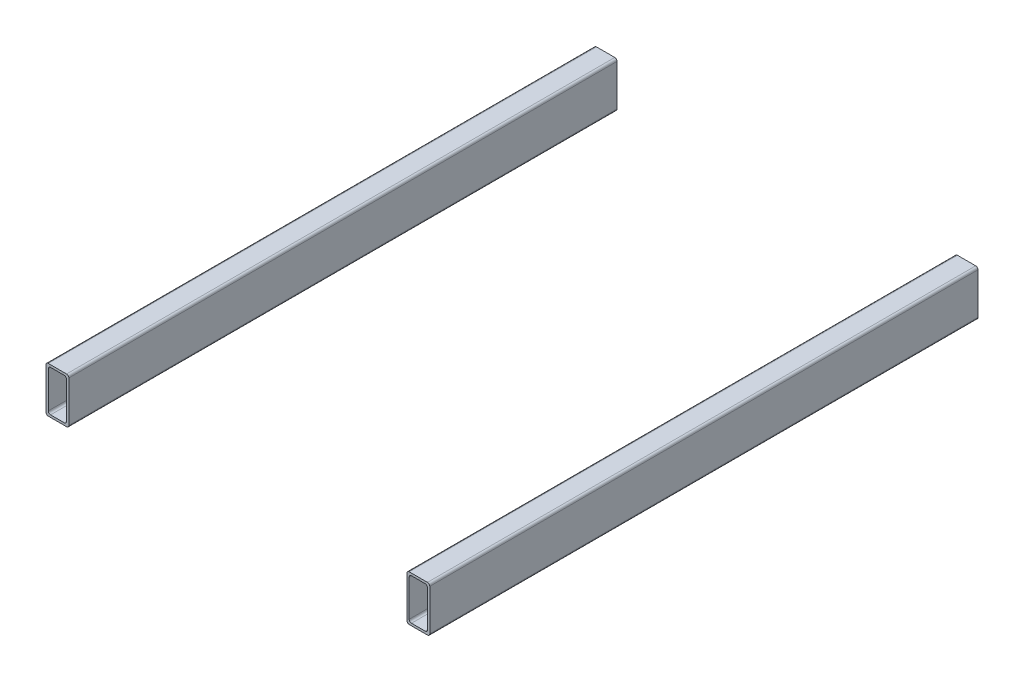
ISO-10303-21;
HEADER;
FILE_DESCRIPTION(('STEP AP214'),'2;1');
FILE_NAME('part.step','',(''),(''),'','','');
FILE_SCHEMA(('AUTOMOTIVE_DESIGN { 1 0 10303 214 1 1 1 1 }'));
ENDSEC;
DATA;
#1=APPLICATION_CONTEXT('core data for automotive mechanical design processes');
#2=APPLICATION_PROTOCOL_DEFINITION('international standard','automotive_design',2000,#1);
#3=PRODUCT_CONTEXT('',#1,'mechanical');
#4=PRODUCT('Part','Part','',(#3));
#5=PRODUCT_RELATED_PRODUCT_CATEGORY('part','',(#4));
#6=PRODUCT_DEFINITION_FORMATION('','',#4);
#7=PRODUCT_DEFINITION_CONTEXT('part definition',#1,'design');
#8=PRODUCT_DEFINITION('design','',#6,#7);
#9=PRODUCT_DEFINITION_SHAPE('','',#8);
#10=(LENGTH_UNIT() NAMED_UNIT(*) SI_UNIT(.MILLI.,.METRE.));
#11=(NAMED_UNIT(*) PLANE_ANGLE_UNIT() SI_UNIT($,.RADIAN.));
#12=(NAMED_UNIT(*) SI_UNIT($,.STERADIAN.) SOLID_ANGLE_UNIT());
#13=UNCERTAINTY_MEASURE_WITH_UNIT(LENGTH_MEASURE(1.E-05),#10,'distance_accuracy_value','');
#14=(GEOMETRIC_REPRESENTATION_CONTEXT(3) GLOBAL_UNCERTAINTY_ASSIGNED_CONTEXT((#13)) GLOBAL_UNIT_ASSIGNED_CONTEXT((#10,
#11,#12)) REPRESENTATION_CONTEXT('',''));
#15=CARTESIAN_POINT('',(0.,0.,0.));
#16=DIRECTION('',(0.,0.,1.));
#17=DIRECTION('',(1.,0.,0.));
#18=AXIS2_PLACEMENT_3D('',#15,#16,#17);
#19=CARTESIAN_POINT('',(385.,47.4999999999999,-600.));
#20=DIRECTION('',(0.,0.,1.));
#21=DIRECTION('',(1.,0.,0.));
#22=AXIS2_PLACEMENT_3D('',#19,#20,#21);
#23=CYLINDRICAL_SURFACE('',#22,2.50000000000028);
#24=CARTESIAN_POINT('',(385.,47.4999999999999,0.));
#25=DIRECTION('',(0.,0.,1.));
#26=DIRECTION('',(1.,0.,0.));
#27=AXIS2_PLACEMENT_3D('',#24,#25,#26);
#28=CIRCLE('',#27,2.50000000000028);
#29=CARTESIAN_POINT('',(385.,50.,0.));
#30=VERTEX_POINT('',#29);
#31=CARTESIAN_POINT('',(382.499999999999,47.4999999999999,0.));
#32=VERTEX_POINT('',#31);
#33=EDGE_CURVE('E213',#30,#32,#28,.T.);
#34=ORIENTED_EDGE('',*,*,#33,.F.);
#35=DIRECTION('',(0.,0.,1.));
#36=VECTOR('',#35,1.);
#37=CARTESIAN_POINT('',(385.,50.,-600.));
#38=LINE('',#37,#36);
#39=CARTESIAN_POINT('',(385.,50.,-600.));
#40=VERTEX_POINT('',#39);
#41=EDGE_CURVE('E12',#40,#30,#38,.T.);
#42=ORIENTED_EDGE('',*,*,#41,.F.);
#43=CARTESIAN_POINT('',(385.,47.4999999999999,-600.));
#44=DIRECTION('',(0.,0.,1.));
#45=DIRECTION('',(1.,0.,0.));
#46=AXIS2_PLACEMENT_3D('',#43,#44,#45);
#47=CIRCLE('',#46,2.50000000000028);
#48=CARTESIAN_POINT('',(382.499999999999,47.4999999999999,-600.));
#49=VERTEX_POINT('',#48);
#50=EDGE_CURVE('E225',#40,#49,#47,.T.);
#51=ORIENTED_EDGE('',*,*,#50,.T.);
#52=DIRECTION('',(0.,0.,1.));
#53=VECTOR('',#52,1.);
#54=CARTESIAN_POINT('',(382.499999999999,47.4999999999999,-600.));
#55=LINE('',#54,#53);
#56=EDGE_CURVE('E46',#49,#32,#55,.T.);
#57=ORIENTED_EDGE('',*,*,#56,.T.);
#58=EDGE_LOOP('',(#34,#42,#51,#57));
#59=FACE_BOUND('',#58,.T.);
#60=ADVANCED_FACE('F43',(#59),#23,.T.);
#61=CARTESIAN_POINT('',(385.,50.,-600.));
#62=DIRECTION('',(0.,1.,0.));
#63=DIRECTION('',(0.,0.,1.));
#64=AXIS2_PLACEMENT_3D('',#61,#62,#63);
#65=PLANE('',#64);
#66=DIRECTION('',(-1.,0.,0.));
#67=VECTOR('',#66,1.);
#68=CARTESIAN_POINT('',(385.,50.,0.));
#69=LINE('',#68,#67);
#70=CARTESIAN_POINT('',(404.999999999999,50.,0.));
#71=VERTEX_POINT('',#70);
#72=EDGE_CURVE('E229',#71,#30,#69,.T.);
#73=ORIENTED_EDGE('',*,*,#72,.F.);
#74=DIRECTION('',(0.,0.,1.));
#75=VECTOR('',#74,1.);
#76=CARTESIAN_POINT('',(404.999999999999,50.,-600.));
#77=LINE('',#76,#75);
#78=CARTESIAN_POINT('',(404.999999999999,50.,-600.));
#79=VERTEX_POINT('',#78);
#80=EDGE_CURVE('E51',#79,#71,#77,.T.);
#81=ORIENTED_EDGE('',*,*,#80,.F.);
#82=DIRECTION('',(-1.,0.,0.));
#83=VECTOR('',#82,1.);
#84=CARTESIAN_POINT('',(385.,50.,-600.));
#85=LINE('',#84,#83);
#86=EDGE_CURVE('E247',#79,#40,#85,.T.);
#87=ORIENTED_EDGE('',*,*,#86,.T.);
#88=ORIENTED_EDGE('',*,*,#41,.T.);
#89=EDGE_LOOP('',(#73,#81,#87,#88));
#90=FACE_BOUND('',#89,.T.);
#91=ADVANCED_FACE('F294',(#90),#65,.T.);
#92=CARTESIAN_POINT('',(404.999999999999,47.4999999999999,-600.));
#93=DIRECTION('',(0.,0.,1.));
#94=DIRECTION('',(1.,0.,0.));
#95=AXIS2_PLACEMENT_3D('',#92,#93,#94);
#96=CYLINDRICAL_SURFACE('',#95,2.50000000000028);
#97=CARTESIAN_POINT('',(404.999999999999,47.4999999999999,0.));
#98=DIRECTION('',(0.,0.,1.));
#99=DIRECTION('',(1.,0.,0.));
#100=AXIS2_PLACEMENT_3D('',#97,#98,#99);
#101=CIRCLE('',#100,2.50000000000028);
#102=CARTESIAN_POINT('',(407.5,47.4999999999999,0.));
#103=VERTEX_POINT('',#102);
#104=EDGE_CURVE('E267',#103,#71,#101,.T.);
#105=ORIENTED_EDGE('',*,*,#104,.F.);
#106=DIRECTION('',(0.,0.,1.));
#107=VECTOR('',#106,1.);
#108=CARTESIAN_POINT('',(407.5,47.4999999999999,-600.));
#109=LINE('',#108,#107);
#110=CARTESIAN_POINT('',(407.5,47.4999999999999,-600.));
#111=VERTEX_POINT('',#110);
#112=EDGE_CURVE('E273',#111,#103,#109,.T.);
#113=ORIENTED_EDGE('',*,*,#112,.F.);
#114=CARTESIAN_POINT('',(404.999999999999,47.4999999999999,-600.));
#115=DIRECTION('',(0.,0.,1.));
#116=DIRECTION('',(1.,0.,0.));
#117=AXIS2_PLACEMENT_3D('',#114,#115,#116);
#118=CIRCLE('',#117,2.50000000000028);
#119=EDGE_CURVE('E244',#111,#79,#118,.T.);
#120=ORIENTED_EDGE('',*,*,#119,.T.);
#121=ORIENTED_EDGE('',*,*,#80,.T.);
#122=EDGE_LOOP('',(#105,#113,#120,#121));
#123=FACE_BOUND('',#122,.T.);
#124=ADVANCED_FACE('F313',(#123),#96,.T.);
#125=CARTESIAN_POINT('',(407.5,47.4999999999999,-600.));
#126=DIRECTION('',(1.,0.,0.));
#127=DIRECTION('',(0.,0.,-1.));
#128=AXIS2_PLACEMENT_3D('',#125,#126,#127);
#129=PLANE('',#128);
#130=DIRECTION('',(0.,1.,0.));
#131=VECTOR('',#130,1.);
#132=CARTESIAN_POINT('',(407.5,47.4999999999999,0.));
#133=LINE('',#132,#131);
#134=CARTESIAN_POINT('',(407.5,2.49999999999995,0.));
#135=VERTEX_POINT('',#134);
#136=EDGE_CURVE('E264',#135,#103,#133,.T.);
#137=ORIENTED_EDGE('',*,*,#136,.F.);
#138=DIRECTION('',(0.,0.,1.));
#139=VECTOR('',#138,1.);
#140=CARTESIAN_POINT('',(407.5,2.49999999999995,-600.));
#141=LINE('',#140,#139);
#142=CARTESIAN_POINT('',(407.5,2.49999999999995,-600.));
#143=VERTEX_POINT('',#142);
#144=EDGE_CURVE('E275',#143,#135,#141,.T.);
#145=ORIENTED_EDGE('',*,*,#144,.F.);
#146=DIRECTION('',(0.,1.,0.));
#147=VECTOR('',#146,1.);
#148=CARTESIAN_POINT('',(407.5,47.4999999999999,-600.));
#149=LINE('',#148,#147);
#150=EDGE_CURVE('E241',#143,#111,#149,.T.);
#151=ORIENTED_EDGE('',*,*,#150,.T.);
#152=ORIENTED_EDGE('',*,*,#112,.T.);
#153=EDGE_LOOP('',(#137,#145,#151,#152));
#154=FACE_BOUND('',#153,.T.);
#155=ADVANCED_FACE('F311',(#154),#129,.T.);
#156=CARTESIAN_POINT('',(404.999999999999,2.49999999999995,-600.));
#157=DIRECTION('',(0.,0.,1.));
#158=DIRECTION('',(1.,0.,0.));
#159=AXIS2_PLACEMENT_3D('',#156,#157,#158);
#160=CYLINDRICAL_SURFACE('',#159,2.50000000000017);
#161=CARTESIAN_POINT('',(404.999999999999,2.49999999999995,0.));
#162=DIRECTION('',(0.,0.,1.));
#163=DIRECTION('',(1.,0.,0.));
#164=AXIS2_PLACEMENT_3D('',#161,#162,#163);
#165=CIRCLE('',#164,2.50000000000017);
#166=CARTESIAN_POINT('',(404.999999999999,-2.22044604925031E-13,0.));
#167=VERTEX_POINT('',#166);
#168=EDGE_CURVE('E261',#167,#135,#165,.T.);
#169=ORIENTED_EDGE('',*,*,#168,.F.);
#170=DIRECTION('',(0.,0.,1.));
#171=VECTOR('',#170,1.);
#172=CARTESIAN_POINT('',(404.999999999999,-2.22044604925031E-13,-600.));
#173=LINE('',#172,#171);
#174=CARTESIAN_POINT('',(404.999999999999,-2.22044604925031E-13,-600.));
#175=VERTEX_POINT('',#174);
#176=EDGE_CURVE('E277',#175,#167,#173,.T.);
#177=ORIENTED_EDGE('',*,*,#176,.F.);
#178=CARTESIAN_POINT('',(404.999999999999,2.49999999999995,-600.));
#179=DIRECTION('',(0.,0.,1.));
#180=DIRECTION('',(1.,0.,0.));
#181=AXIS2_PLACEMENT_3D('',#178,#179,#180);
#182=CIRCLE('',#181,2.50000000000017);
#183=EDGE_CURVE('E238',#175,#143,#182,.T.);
#184=ORIENTED_EDGE('',*,*,#183,.T.);
#185=ORIENTED_EDGE('',*,*,#144,.T.);
#186=EDGE_LOOP('',(#169,#177,#184,#185));
#187=FACE_BOUND('',#186,.T.);
#188=ADVANCED_FACE('F307',(#187),#160,.T.);
#189=CARTESIAN_POINT('',(404.999999999999,0.,-600.));
#190=DIRECTION('',(0.,-1.,0.));
#191=DIRECTION('',(0.,0.,-1.));
#192=AXIS2_PLACEMENT_3D('',#189,#190,#191);
#193=PLANE('',#192);
#194=DIRECTION('',(1.,0.,0.));
#195=VECTOR('',#194,1.);
#196=CARTESIAN_POINT('',(404.999999999999,0.,0.));
#197=LINE('',#196,#195);
#198=CARTESIAN_POINT('',(385.,0.,0.));
#199=VERTEX_POINT('',#198);
#200=EDGE_CURVE('E258',#199,#167,#197,.T.);
#201=ORIENTED_EDGE('',*,*,#200,.F.);
#202=DIRECTION('',(0.,0.,1.));
#203=VECTOR('',#202,1.);
#204=CARTESIAN_POINT('',(385.,0.,-600.));
#205=LINE('',#204,#203);
#206=CARTESIAN_POINT('',(385.,0.,-600.));
#207=VERTEX_POINT('',#206);
#208=EDGE_CURVE('E279',#207,#199,#205,.T.);
#209=ORIENTED_EDGE('',*,*,#208,.F.);
#210=DIRECTION('',(1.,0.,0.));
#211=VECTOR('',#210,1.);
#212=CARTESIAN_POINT('',(404.999999999999,0.,-600.));
#213=LINE('',#212,#211);
#214=EDGE_CURVE('E235',#207,#175,#213,.T.);
#215=ORIENTED_EDGE('',*,*,#214,.T.);
#216=ORIENTED_EDGE('',*,*,#176,.T.);
#217=EDGE_LOOP('',(#201,#209,#215,#216));
#218=FACE_BOUND('',#217,.T.);
#219=ADVANCED_FACE('F305',(#218),#193,.T.);
#220=CARTESIAN_POINT('',(385.,2.49999999999995,-600.));
#221=DIRECTION('',(0.,0.,1.));
#222=DIRECTION('',(1.,0.,0.));
#223=AXIS2_PLACEMENT_3D('',#220,#221,#222);
#224=CYLINDRICAL_SURFACE('',#223,2.50000000000017);
#225=CARTESIAN_POINT('',(385.,2.49999999999995,0.));
#226=DIRECTION('',(0.,0.,1.));
#227=DIRECTION('',(1.,0.,0.));
#228=AXIS2_PLACEMENT_3D('',#225,#226,#227);
#229=CIRCLE('',#228,2.50000000000017);
#230=CARTESIAN_POINT('',(382.5,2.49999999999995,0.));
#231=VERTEX_POINT('',#230);
#232=EDGE_CURVE('E255',#231,#199,#229,.T.);
#233=ORIENTED_EDGE('',*,*,#232,.F.);
#234=DIRECTION('',(0.,0.,1.));
#235=VECTOR('',#234,1.);
#236=CARTESIAN_POINT('',(382.5,2.49999999999995,-600.));
#237=LINE('',#236,#235);
#238=CARTESIAN_POINT('',(382.5,2.49999999999995,-600.));
#239=VERTEX_POINT('',#238);
#240=EDGE_CURVE('E280',#239,#231,#237,.T.);
#241=ORIENTED_EDGE('',*,*,#240,.F.);
#242=CARTESIAN_POINT('',(385.,2.49999999999995,-600.));
#243=DIRECTION('',(0.,0.,1.));
#244=DIRECTION('',(1.,0.,0.));
#245=AXIS2_PLACEMENT_3D('',#242,#243,#244);
#246=CIRCLE('',#245,2.50000000000017);
#247=EDGE_CURVE('E232',#239,#207,#246,.T.);
#248=ORIENTED_EDGE('',*,*,#247,.T.);
#249=ORIENTED_EDGE('',*,*,#208,.T.);
#250=EDGE_LOOP('',(#233,#241,#248,#249));
#251=FACE_BOUND('',#250,.T.);
#252=ADVANCED_FACE('F301',(#251),#224,.T.);
#253=CARTESIAN_POINT('',(382.499999999999,2.49999999999995,-600.));
#254=DIRECTION('',(-1.,0.,0.));
#255=DIRECTION('',(0.,0.,1.));
#256=AXIS2_PLACEMENT_3D('',#253,#254,#255);
#257=PLANE('',#256);
#258=DIRECTION('',(0.,-1.,0.));
#259=VECTOR('',#258,1.);
#260=CARTESIAN_POINT('',(382.499999999999,2.49999999999995,0.));
#261=LINE('',#260,#259);
#262=EDGE_CURVE('E252',#32,#231,#261,.T.);
#263=ORIENTED_EDGE('',*,*,#262,.F.);
#264=ORIENTED_EDGE('',*,*,#56,.F.);
#265=DIRECTION('',(0.,-1.,0.));
#266=VECTOR('',#265,1.);
#267=CARTESIAN_POINT('',(382.499999999999,2.49999999999995,-600.));
#268=LINE('',#267,#266);
#269=EDGE_CURVE('E228',#49,#239,#268,.T.);
#270=ORIENTED_EDGE('',*,*,#269,.T.);
#271=ORIENTED_EDGE('',*,*,#240,.T.);
#272=EDGE_LOOP('',(#263,#264,#270,#271));
#273=FACE_BOUND('',#272,.T.);
#274=ADVANCED_FACE('F288',(#273),#257,.T.);
#275=CARTESIAN_POINT('',(385.,47.4999999999999,-600.));
#276=DIRECTION('',(0.,0.,1.));
#277=DIRECTION('',(1.,0.,0.));
#278=AXIS2_PLACEMENT_3D('',#275,#276,#277);
#279=PLANE('',#278);
#280=DIRECTION('',(-1.,0.,0.));
#281=VECTOR('',#280,1.);
#282=CARTESIAN_POINT('',(387.499999999999,47.4999999999999,-600.));
#283=LINE('',#282,#281);
#284=CARTESIAN_POINT('',(402.5,47.4999999999999,-600.));
#285=VERTEX_POINT('',#284);
#286=CARTESIAN_POINT('',(387.499999999999,47.4999999999999,-600.));
#287=VERTEX_POINT('',#286);
#288=EDGE_CURVE('E164',#285,#287,#283,.T.);
#289=ORIENTED_EDGE('',*,*,#288,.T.);
#290=CARTESIAN_POINT('',(387.499999999999,44.9999999999999,-600.));
#291=DIRECTION('',(0.,0.,1.));
#292=DIRECTION('',(1.,0.,0.));
#293=AXIS2_PLACEMENT_3D('',#290,#291,#292);
#294=CIRCLE('',#293,2.49999999999972);
#295=CARTESIAN_POINT('',(385.,44.9999999999999,-600.));
#296=VERTEX_POINT('',#295);
#297=EDGE_CURVE('E158',#287,#296,#294,.T.);
#298=ORIENTED_EDGE('',*,*,#297,.T.);
#299=DIRECTION('',(0.,-1.,0.));
#300=VECTOR('',#299,1.);
#301=CARTESIAN_POINT('',(385.,4.99999999999989,-600.));
#302=LINE('',#301,#300);
#303=CARTESIAN_POINT('',(385.,4.99999999999989,-600.));
#304=VERTEX_POINT('',#303);
#305=EDGE_CURVE('E167',#296,#304,#302,.T.);
#306=ORIENTED_EDGE('',*,*,#305,.T.);
#307=CARTESIAN_POINT('',(387.499999999999,4.99999999999989,-600.));
#308=DIRECTION('',(0.,0.,1.));
#309=DIRECTION('',(1.,0.,0.));
#310=AXIS2_PLACEMENT_3D('',#307,#308,#309);
#311=CIRCLE('',#310,2.49999999999972);
#312=CARTESIAN_POINT('',(387.499999999999,2.49999999999995,-600.));
#313=VERTEX_POINT('',#312);
#314=EDGE_CURVE('E59',#304,#313,#311,.T.);
#315=ORIENTED_EDGE('',*,*,#314,.T.);
#316=DIRECTION('',(1.,0.,0.));
#317=VECTOR('',#316,1.);
#318=CARTESIAN_POINT('',(402.499999999999,2.49999999999995,-600.));
#319=LINE('',#318,#317);
#320=CARTESIAN_POINT('',(402.499999999999,2.49999999999972,-600.));
#321=VERTEX_POINT('',#320);
#322=EDGE_CURVE('E182',#313,#321,#319,.T.);
#323=ORIENTED_EDGE('',*,*,#322,.T.);
#324=CARTESIAN_POINT('',(402.499999999999,4.99999999999989,-600.));
#325=DIRECTION('',(0.,0.,1.));
#326=DIRECTION('',(1.,0.,0.));
#327=AXIS2_PLACEMENT_3D('',#324,#325,#326);
#328=CIRCLE('',#327,2.50000000000017);
#329=CARTESIAN_POINT('',(404.999999999999,4.99999999999989,-600.));
#330=VERTEX_POINT('',#329);
#331=EDGE_CURVE('E185',#321,#330,#328,.T.);
#332=ORIENTED_EDGE('',*,*,#331,.T.);
#333=DIRECTION('',(0.,1.,0.));
#334=VECTOR('',#333,1.);
#335=CARTESIAN_POINT('',(404.999999999999,44.9999999999999,-600.));
#336=LINE('',#335,#334);
#337=CARTESIAN_POINT('',(404.999999999999,44.9999999999999,-600.));
#338=VERTEX_POINT('',#337);
#339=EDGE_CURVE('E188',#330,#338,#336,.T.);
#340=ORIENTED_EDGE('',*,*,#339,.T.);
#341=CARTESIAN_POINT('',(402.499999999999,44.9999999999999,-600.));
#342=DIRECTION('',(0.,0.,1.));
#343=DIRECTION('',(1.,0.,0.));
#344=AXIS2_PLACEMENT_3D('',#341,#342,#343);
#345=CIRCLE('',#344,2.50000000000017);
#346=EDGE_CURVE('E191',#338,#285,#345,.T.);
#347=ORIENTED_EDGE('',*,*,#346,.T.);
#348=EDGE_LOOP('',(#289,#298,#306,#315,#323,#332,#340,#347));
#349=FACE_BOUND('',#348,.T.);
#350=ORIENTED_EDGE('',*,*,#50,.F.);
#351=ORIENTED_EDGE('',*,*,#86,.F.);
#352=ORIENTED_EDGE('',*,*,#119,.F.);
#353=ORIENTED_EDGE('',*,*,#150,.F.);
#354=ORIENTED_EDGE('',*,*,#183,.F.);
#355=ORIENTED_EDGE('',*,*,#214,.F.);
#356=ORIENTED_EDGE('',*,*,#247,.F.);
#357=ORIENTED_EDGE('',*,*,#269,.F.);
#358=EDGE_LOOP('',(#350,#351,#352,#353,#354,#355,#356,#357));
#359=FACE_BOUND('',#358,.T.);
#360=ADVANCED_FACE('F171',(#349,#359),#279,.F.);
#361=CARTESIAN_POINT('',(385.,47.4999999999999,0.));
#362=DIRECTION('',(0.,0.,1.));
#363=DIRECTION('',(1.,0.,0.));
#364=AXIS2_PLACEMENT_3D('',#361,#362,#363);
#365=PLANE('',#364);
#366=CARTESIAN_POINT('',(387.499999999999,44.9999999999999,0.));
#367=DIRECTION('',(0.,0.,1.));
#368=DIRECTION('',(1.,0.,0.));
#369=AXIS2_PLACEMENT_3D('',#366,#367,#368);
#370=CIRCLE('',#369,2.49999999999972);
#371=CARTESIAN_POINT('',(387.499999999999,47.4999999999999,0.));
#372=VERTEX_POINT('',#371);
#373=CARTESIAN_POINT('',(385.,44.9999999999999,0.));
#374=VERTEX_POINT('',#373);
#375=EDGE_CURVE('E67',#372,#374,#370,.T.);
#376=ORIENTED_EDGE('',*,*,#375,.F.);
#377=DIRECTION('',(-1.,0.,0.));
#378=VECTOR('',#377,1.);
#379=CARTESIAN_POINT('',(387.499999999999,47.4999999999999,0.));
#380=LINE('',#379,#378);
#381=CARTESIAN_POINT('',(402.5,47.4999999999999,0.));
#382=VERTEX_POINT('',#381);
#383=EDGE_CURVE('E175',#382,#372,#380,.T.);
#384=ORIENTED_EDGE('',*,*,#383,.F.);
#385=CARTESIAN_POINT('',(402.499999999999,44.9999999999999,0.));
#386=DIRECTION('',(0.,0.,1.));
#387=DIRECTION('',(1.,0.,0.));
#388=AXIS2_PLACEMENT_3D('',#385,#386,#387);
#389=CIRCLE('',#388,2.50000000000017);
#390=CARTESIAN_POINT('',(404.999999999999,44.9999999999999,0.));
#391=VERTEX_POINT('',#390);
#392=EDGE_CURVE('E178',#391,#382,#389,.T.);
#393=ORIENTED_EDGE('',*,*,#392,.F.);
#394=DIRECTION('',(0.,1.,0.));
#395=VECTOR('',#394,1.);
#396=CARTESIAN_POINT('',(404.999999999999,44.9999999999999,0.));
#397=LINE('',#396,#395);
#398=CARTESIAN_POINT('',(404.999999999999,4.99999999999989,0.));
#399=VERTEX_POINT('',#398);
#400=EDGE_CURVE('E206',#399,#391,#397,.T.);
#401=ORIENTED_EDGE('',*,*,#400,.F.);
#402=CARTESIAN_POINT('',(402.499999999999,4.99999999999989,0.));
#403=DIRECTION('',(0.,0.,1.));
#404=DIRECTION('',(1.,0.,0.));
#405=AXIS2_PLACEMENT_3D('',#402,#403,#404);
#406=CIRCLE('',#405,2.50000000000017);
#407=CARTESIAN_POINT('',(402.499999999999,2.49999999999972,0.));
#408=VERTEX_POINT('',#407);
#409=EDGE_CURVE('E203',#408,#399,#406,.T.);
#410=ORIENTED_EDGE('',*,*,#409,.F.);
#411=DIRECTION('',(1.,0.,0.));
#412=VECTOR('',#411,1.);
#413=CARTESIAN_POINT('',(402.499999999999,2.49999999999995,0.));
#414=LINE('',#413,#412);
#415=CARTESIAN_POINT('',(387.499999999999,2.49999999999995,0.));
#416=VERTEX_POINT('',#415);
#417=EDGE_CURVE('E200',#416,#408,#414,.T.);
#418=ORIENTED_EDGE('',*,*,#417,.F.);
#419=CARTESIAN_POINT('',(387.499999999999,4.99999999999989,0.));
#420=DIRECTION('',(0.,0.,1.));
#421=DIRECTION('',(1.,0.,0.));
#422=AXIS2_PLACEMENT_3D('',#419,#420,#421);
#423=CIRCLE('',#422,2.49999999999972);
#424=CARTESIAN_POINT('',(385.,4.99999999999989,0.));
#425=VERTEX_POINT('',#424);
#426=EDGE_CURVE('E197',#425,#416,#423,.T.);
#427=ORIENTED_EDGE('',*,*,#426,.F.);
#428=DIRECTION('',(0.,-1.,0.));
#429=VECTOR('',#428,1.);
#430=CARTESIAN_POINT('',(385.,4.99999999999989,0.));
#431=LINE('',#430,#429);
#432=EDGE_CURVE('E195',#374,#425,#431,.T.);
#433=ORIENTED_EDGE('',*,*,#432,.F.);
#434=EDGE_LOOP('',(#376,#384,#393,#401,#410,#418,#427,#433));
#435=FACE_BOUND('',#434,.T.);
#436=ORIENTED_EDGE('',*,*,#33,.T.);
#437=ORIENTED_EDGE('',*,*,#262,.T.);
#438=ORIENTED_EDGE('',*,*,#232,.T.);
#439=ORIENTED_EDGE('',*,*,#200,.T.);
#440=ORIENTED_EDGE('',*,*,#168,.T.);
#441=ORIENTED_EDGE('',*,*,#136,.T.);
#442=ORIENTED_EDGE('',*,*,#104,.T.);
#443=ORIENTED_EDGE('',*,*,#72,.T.);
#444=EDGE_LOOP('',(#436,#437,#438,#439,#440,#441,#442,#443));
#445=FACE_BOUND('',#444,.T.);
#446=ADVANCED_FACE('F290',(#435,#445),#365,.T.);
#447=CARTESIAN_POINT('',(387.499999999999,44.9999999999999,-600.));
#448=DIRECTION('',(0.,0.,1.));
#449=DIRECTION('',(1.,0.,0.));
#450=AXIS2_PLACEMENT_3D('',#447,#448,#449);
#451=CYLINDRICAL_SURFACE('',#450,2.49999999999972);
#452=ORIENTED_EDGE('',*,*,#375,.T.);
#453=DIRECTION('',(0.,0.,1.));
#454=VECTOR('',#453,1.);
#455=CARTESIAN_POINT('',(385.,44.9999999999999,-600.));
#456=LINE('',#455,#454);
#457=EDGE_CURVE('E154',#296,#374,#456,.T.);
#458=ORIENTED_EDGE('',*,*,#457,.F.);
#459=ORIENTED_EDGE('',*,*,#297,.F.);
#460=DIRECTION('',(0.,0.,1.));
#461=VECTOR('',#460,1.);
#462=CARTESIAN_POINT('',(387.499999999999,47.4999999999999,-600.));
#463=LINE('',#462,#461);
#464=EDGE_CURVE('E211',#287,#372,#463,.T.);
#465=ORIENTED_EDGE('',*,*,#464,.T.);
#466=EDGE_LOOP('',(#452,#458,#459,#465));
#467=FACE_BOUND('',#466,.T.);
#468=ADVANCED_FACE('F156',(#467),#451,.F.);
#469=CARTESIAN_POINT('',(387.499999999999,47.4999999999999,-600.));
#470=DIRECTION('',(0.,1.,0.));
#471=DIRECTION('',(0.,0.,1.));
#472=AXIS2_PLACEMENT_3D('',#469,#470,#471);
#473=PLANE('',#472);
#474=ORIENTED_EDGE('',*,*,#383,.T.);
#475=ORIENTED_EDGE('',*,*,#464,.F.);
#476=ORIENTED_EDGE('',*,*,#288,.F.);
#477=DIRECTION('',(0.,0.,1.));
#478=VECTOR('',#477,1.);
#479=CARTESIAN_POINT('',(402.5,47.4999999999999,-600.));
#480=LINE('',#479,#478);
#481=EDGE_CURVE('E214',#285,#382,#480,.T.);
#482=ORIENTED_EDGE('',*,*,#481,.T.);
#483=EDGE_LOOP('',(#474,#475,#476,#482));
#484=FACE_BOUND('',#483,.T.);
#485=ADVANCED_FACE('F396',(#484),#473,.F.);
#486=CARTESIAN_POINT('',(402.499999999999,44.9999999999999,-600.));
#487=DIRECTION('',(0.,0.,1.));
#488=DIRECTION('',(1.,0.,0.));
#489=AXIS2_PLACEMENT_3D('',#486,#487,#488);
#490=CYLINDRICAL_SURFACE('',#489,2.50000000000017);
#491=ORIENTED_EDGE('',*,*,#392,.T.);
#492=ORIENTED_EDGE('',*,*,#481,.F.);
#493=ORIENTED_EDGE('',*,*,#346,.F.);
#494=DIRECTION('',(0.,0.,1.));
#495=VECTOR('',#494,1.);
#496=CARTESIAN_POINT('',(404.999999999999,44.9999999999999,-600.));
#497=LINE('',#496,#495);
#498=EDGE_CURVE('E216',#338,#391,#497,.T.);
#499=ORIENTED_EDGE('',*,*,#498,.T.);
#500=EDGE_LOOP('',(#491,#492,#493,#499));
#501=FACE_BOUND('',#500,.T.);
#502=ADVANCED_FACE('F405',(#501),#490,.F.);
#503=CARTESIAN_POINT('',(404.999999999999,44.9999999999999,-600.));
#504=DIRECTION('',(1.,0.,0.));
#505=DIRECTION('',(0.,0.,-1.));
#506=AXIS2_PLACEMENT_3D('',#503,#504,#505);
#507=PLANE('',#506);
#508=ORIENTED_EDGE('',*,*,#400,.T.);
#509=ORIENTED_EDGE('',*,*,#498,.F.);
#510=ORIENTED_EDGE('',*,*,#339,.F.);
#511=DIRECTION('',(0.,0.,1.));
#512=VECTOR('',#511,1.);
#513=CARTESIAN_POINT('',(404.999999999999,4.99999999999989,-600.));
#514=LINE('',#513,#512);
#515=EDGE_CURVE('E218',#330,#399,#514,.T.);
#516=ORIENTED_EDGE('',*,*,#515,.T.);
#517=EDGE_LOOP('',(#508,#509,#510,#516));
#518=FACE_BOUND('',#517,.T.);
#519=ADVANCED_FACE('F415',(#518),#507,.F.);
#520=CARTESIAN_POINT('',(402.499999999999,4.99999999999989,-600.));
#521=DIRECTION('',(0.,0.,1.));
#522=DIRECTION('',(1.,0.,0.));
#523=AXIS2_PLACEMENT_3D('',#520,#521,#522);
#524=CYLINDRICAL_SURFACE('',#523,2.50000000000017);
#525=ORIENTED_EDGE('',*,*,#409,.T.);
#526=ORIENTED_EDGE('',*,*,#515,.F.);
#527=ORIENTED_EDGE('',*,*,#331,.F.);
#528=DIRECTION('',(0.,0.,1.));
#529=VECTOR('',#528,1.);
#530=CARTESIAN_POINT('',(402.499999999999,2.49999999999972,-600.));
#531=LINE('',#530,#529);
#532=EDGE_CURVE('E220',#321,#408,#531,.T.);
#533=ORIENTED_EDGE('',*,*,#532,.T.);
#534=EDGE_LOOP('',(#525,#526,#527,#533));
#535=FACE_BOUND('',#534,.T.);
#536=ADVANCED_FACE('F425',(#535),#524,.F.);
#537=CARTESIAN_POINT('',(402.499999999999,2.49999999999995,-600.));
#538=DIRECTION('',(0.,-1.,0.));
#539=DIRECTION('',(0.,0.,-1.));
#540=AXIS2_PLACEMENT_3D('',#537,#538,#539);
#541=PLANE('',#540);
#542=ORIENTED_EDGE('',*,*,#417,.T.);
#543=ORIENTED_EDGE('',*,*,#532,.F.);
#544=ORIENTED_EDGE('',*,*,#322,.F.);
#545=DIRECTION('',(0.,0.,1.));
#546=VECTOR('',#545,1.);
#547=CARTESIAN_POINT('',(387.499999999999,2.49999999999995,-600.));
#548=LINE('',#547,#546);
#549=EDGE_CURVE('E222',#313,#416,#548,.T.);
#550=ORIENTED_EDGE('',*,*,#549,.T.);
#551=EDGE_LOOP('',(#542,#543,#544,#550));
#552=FACE_BOUND('',#551,.T.);
#553=ADVANCED_FACE('F435',(#552),#541,.F.);
#554=CARTESIAN_POINT('',(387.499999999999,4.99999999999989,-600.));
#555=DIRECTION('',(0.,0.,1.));
#556=DIRECTION('',(1.,0.,0.));
#557=AXIS2_PLACEMENT_3D('',#554,#555,#556);
#558=CYLINDRICAL_SURFACE('',#557,2.49999999999972);
#559=ORIENTED_EDGE('',*,*,#426,.T.);
#560=ORIENTED_EDGE('',*,*,#549,.F.);
#561=ORIENTED_EDGE('',*,*,#314,.F.);
#562=DIRECTION('',(0.,0.,1.));
#563=VECTOR('',#562,1.);
#564=CARTESIAN_POINT('',(385.,4.99999999999989,-600.));
#565=LINE('',#564,#563);
#566=EDGE_CURVE('E163',#304,#425,#565,.T.);
#567=ORIENTED_EDGE('',*,*,#566,.T.);
#568=EDGE_LOOP('',(#559,#560,#561,#567));
#569=FACE_BOUND('',#568,.T.);
#570=ADVANCED_FACE('F445',(#569),#558,.F.);
#571=CARTESIAN_POINT('',(385.,4.99999999999989,-600.));
#572=DIRECTION('',(-1.,0.,0.));
#573=DIRECTION('',(0.,0.,1.));
#574=AXIS2_PLACEMENT_3D('',#571,#572,#573);
#575=PLANE('',#574);
#576=ORIENTED_EDGE('',*,*,#432,.T.);
#577=ORIENTED_EDGE('',*,*,#566,.F.);
#578=ORIENTED_EDGE('',*,*,#305,.F.);
#579=ORIENTED_EDGE('',*,*,#457,.T.);
#580=EDGE_LOOP('',(#576,#577,#578,#579));
#581=FACE_BOUND('',#580,.T.);
#582=ADVANCED_FACE('F168',(#581),#575,.F.);
#583=CLOSED_SHELL('',(#60,#91,#124,#155,#188,#219,#252,#274,#360,#446,#468,#485,#502,#519,#536,
#553,#570,#582));
#584=MANIFOLD_SOLID_BREP('B2',#583);
#585=CARTESIAN_POINT('',(-10.0000000000002,47.4999999999999,-600.));
#586=DIRECTION('',(0.,0.,1.));
#587=DIRECTION('',(1.,0.,0.));
#588=AXIS2_PLACEMENT_3D('',#585,#586,#587);
#589=CYLINDRICAL_SURFACE('',#588,2.50000000000006);
#590=CARTESIAN_POINT('',(-10.0000000000002,47.4999999999999,0.));
#591=DIRECTION('',(0.,0.,1.));
#592=DIRECTION('',(1.,0.,0.));
#593=AXIS2_PLACEMENT_3D('',#590,#591,#592);
#594=CIRCLE('',#593,2.50000000000006);
#595=CARTESIAN_POINT('',(-10.0000000000002,50.,0.));
#596=VERTEX_POINT('',#595);
#597=CARTESIAN_POINT('',(-12.5000000000002,47.4999999999999,0.));
#598=VERTEX_POINT('',#597);
#599=EDGE_CURVE('E651',#596,#598,#594,.T.);
#600=ORIENTED_EDGE('',*,*,#599,.F.);
#601=DIRECTION('',(0.,0.,1.));
#602=VECTOR('',#601,1.);
#603=CARTESIAN_POINT('',(-10.0000000000002,50.,-600.));
#604=LINE('',#603,#602);
#605=CARTESIAN_POINT('',(-10.0000000000002,50.,-600.));
#606=VERTEX_POINT('',#605);
#607=EDGE_CURVE('E41',#606,#596,#604,.T.);
#608=ORIENTED_EDGE('',*,*,#607,.F.);
#609=CARTESIAN_POINT('',(-10.0000000000002,47.4999999999999,-600.));
#610=DIRECTION('',(0.,0.,1.));
#611=DIRECTION('',(1.,0.,0.));
#612=AXIS2_PLACEMENT_3D('',#609,#610,#611);
#613=CIRCLE('',#612,2.50000000000006);
#614=CARTESIAN_POINT('',(-12.5000000000002,47.4999999999999,-600.));
#615=VERTEX_POINT('',#614);
#616=EDGE_CURVE('E663',#606,#615,#613,.T.);
#617=ORIENTED_EDGE('',*,*,#616,.T.);
#618=DIRECTION('',(0.,0.,1.));
#619=VECTOR('',#618,1.);
#620=CARTESIAN_POINT('',(-12.5000000000002,47.4999999999999,-600.));
#621=LINE('',#620,#619);
#622=EDGE_CURVE('E484',#615,#598,#621,.T.);
#623=ORIENTED_EDGE('',*,*,#622,.T.);
#624=EDGE_LOOP('',(#600,#608,#617,#623));
#625=FACE_BOUND('',#624,.T.);
#626=ADVANCED_FACE('F481',(#625),#589,.T.);
#627=CARTESIAN_POINT('',(-10.0000000000002,50.,-600.));
#628=DIRECTION('',(0.,1.,0.));
#629=DIRECTION('',(0.,0.,1.));
#630=AXIS2_PLACEMENT_3D('',#627,#628,#629);
#631=PLANE('',#630);
#632=DIRECTION('',(-1.,0.,0.));
#633=VECTOR('',#632,1.);
#634=CARTESIAN_POINT('',(-10.0000000000002,50.,0.));
#635=LINE('',#634,#633);
#636=CARTESIAN_POINT('',(9.99999999999979,50.,0.));
#637=VERTEX_POINT('',#636);
#638=EDGE_CURVE('E667',#637,#596,#635,.T.);
#639=ORIENTED_EDGE('',*,*,#638,.F.);
#640=DIRECTION('',(0.,0.,1.));
#641=VECTOR('',#640,1.);
#642=CARTESIAN_POINT('',(9.99999999999979,50.,-600.));
#643=LINE('',#642,#641);
#644=CARTESIAN_POINT('',(9.99999999999979,50.,-600.));
#645=VERTEX_POINT('',#644);
#646=EDGE_CURVE('E489',#645,#637,#643,.T.);
#647=ORIENTED_EDGE('',*,*,#646,.F.);
#648=DIRECTION('',(-1.,0.,0.));
#649=VECTOR('',#648,1.);
#650=CARTESIAN_POINT('',(-10.0000000000002,50.,-600.));
#651=LINE('',#650,#649);
#652=EDGE_CURVE('E685',#645,#606,#651,.T.);
#653=ORIENTED_EDGE('',*,*,#652,.T.);
#654=ORIENTED_EDGE('',*,*,#607,.T.);
#655=EDGE_LOOP('',(#639,#647,#653,#654));
#656=FACE_BOUND('',#655,.T.);
#657=ADVANCED_FACE('F732',(#656),#631,.T.);
#658=CARTESIAN_POINT('',(9.99999999999934,47.4999999999999,-600.));
#659=DIRECTION('',(0.,0.,1.));
#660=DIRECTION('',(1.,0.,0.));
#661=AXIS2_PLACEMENT_3D('',#658,#659,#660);
#662=CYLINDRICAL_SURFACE('',#661,2.50000000000028);
#663=CARTESIAN_POINT('',(9.99999999999934,47.4999999999999,0.));
#664=DIRECTION('',(0.,0.,1.));
#665=DIRECTION('',(1.,0.,0.));
#666=AXIS2_PLACEMENT_3D('',#663,#664,#665);
#667=CIRCLE('',#666,2.50000000000028);
#668=CARTESIAN_POINT('',(12.4999999999996,47.4999999999999,0.));
#669=VERTEX_POINT('',#668);
#670=EDGE_CURVE('E705',#669,#637,#667,.T.);
#671=ORIENTED_EDGE('',*,*,#670,.F.);
#672=DIRECTION('',(0.,0.,1.));
#673=VECTOR('',#672,1.);
#674=CARTESIAN_POINT('',(12.4999999999996,47.4999999999999,-600.));
#675=LINE('',#674,#673);
#676=CARTESIAN_POINT('',(12.4999999999996,47.4999999999999,-600.));
#677=VERTEX_POINT('',#676);
#678=EDGE_CURVE('E711',#677,#669,#675,.T.);
#679=ORIENTED_EDGE('',*,*,#678,.F.);
#680=CARTESIAN_POINT('',(9.99999999999934,47.4999999999999,-600.));
#681=DIRECTION('',(0.,0.,1.));
#682=DIRECTION('',(1.,0.,0.));
#683=AXIS2_PLACEMENT_3D('',#680,#681,#682);
#684=CIRCLE('',#683,2.50000000000028);
#685=EDGE_CURVE('E682',#677,#645,#684,.T.);
#686=ORIENTED_EDGE('',*,*,#685,.T.);
#687=ORIENTED_EDGE('',*,*,#646,.T.);
#688=EDGE_LOOP('',(#671,#679,#686,#687));
#689=FACE_BOUND('',#688,.T.);
#690=ADVANCED_FACE('F751',(#689),#662,.T.);
#691=CARTESIAN_POINT('',(12.4999999999997,47.4999999999999,-600.));
#692=DIRECTION('',(1.,0.,0.));
#693=DIRECTION('',(0.,0.,-1.));
#694=AXIS2_PLACEMENT_3D('',#691,#692,#693);
#695=PLANE('',#694);
#696=DIRECTION('',(0.,1.,0.));
#697=VECTOR('',#696,1.);
#698=CARTESIAN_POINT('',(12.4999999999997,47.4999999999999,0.));
#699=LINE('',#698,#697);
#700=CARTESIAN_POINT('',(12.4999999999997,2.49999999999995,0.));
#701=VERTEX_POINT('',#700);
#702=EDGE_CURVE('E702',#701,#669,#699,.T.);
#703=ORIENTED_EDGE('',*,*,#702,.F.);
#704=DIRECTION('',(0.,0.,1.));
#705=VECTOR('',#704,1.);
#706=CARTESIAN_POINT('',(12.4999999999997,2.49999999999995,-600.));
#707=LINE('',#706,#705);
#708=CARTESIAN_POINT('',(12.4999999999997,2.49999999999995,-600.));
#709=VERTEX_POINT('',#708);
#710=EDGE_CURVE('E713',#709,#701,#707,.T.);
#711=ORIENTED_EDGE('',*,*,#710,.F.);
#712=DIRECTION('',(0.,1.,0.));
#713=VECTOR('',#712,1.);
#714=CARTESIAN_POINT('',(12.4999999999997,47.4999999999999,-600.));
#715=LINE('',#714,#713);
#716=EDGE_CURVE('E679',#709,#677,#715,.T.);
#717=ORIENTED_EDGE('',*,*,#716,.T.);
#718=ORIENTED_EDGE('',*,*,#678,.T.);
#719=EDGE_LOOP('',(#703,#711,#717,#718));
#720=FACE_BOUND('',#719,.T.);
#721=ADVANCED_FACE('F749',(#720),#695,.T.);
#722=CARTESIAN_POINT('',(9.99999999999934,2.49999999999995,-600.));
#723=DIRECTION('',(0.,0.,1.));
#724=DIRECTION('',(1.,0.,0.));
#725=AXIS2_PLACEMENT_3D('',#722,#723,#724);
#726=CYLINDRICAL_SURFACE('',#725,2.50000000000017);
#727=CARTESIAN_POINT('',(9.99999999999934,2.49999999999995,0.));
#728=DIRECTION('',(0.,0.,1.));
#729=DIRECTION('',(1.,0.,0.));
#730=AXIS2_PLACEMENT_3D('',#727,#728,#729);
#731=CIRCLE('',#730,2.50000000000017);
#732=CARTESIAN_POINT('',(9.99999999999934,-2.22044604925031E-13,0.));
#733=VERTEX_POINT('',#732);
#734=EDGE_CURVE('E699',#733,#701,#731,.T.);
#735=ORIENTED_EDGE('',*,*,#734,.F.);
#736=DIRECTION('',(0.,0.,1.));
#737=VECTOR('',#736,1.);
#738=CARTESIAN_POINT('',(9.99999999999934,-2.22044604925031E-13,-600.));
#739=LINE('',#738,#737);
#740=CARTESIAN_POINT('',(9.99999999999934,-2.22044604925031E-13,-600.));
#741=VERTEX_POINT('',#740);
#742=EDGE_CURVE('E715',#741,#733,#739,.T.);
#743=ORIENTED_EDGE('',*,*,#742,.F.);
#744=CARTESIAN_POINT('',(9.99999999999934,2.49999999999995,-600.));
#745=DIRECTION('',(0.,0.,1.));
#746=DIRECTION('',(1.,0.,0.));
#747=AXIS2_PLACEMENT_3D('',#744,#745,#746);
#748=CIRCLE('',#747,2.50000000000017);
#749=EDGE_CURVE('E676',#741,#709,#748,.T.);
#750=ORIENTED_EDGE('',*,*,#749,.T.);
#751=ORIENTED_EDGE('',*,*,#710,.T.);
#752=EDGE_LOOP('',(#735,#743,#750,#751));
#753=FACE_BOUND('',#752,.T.);
#754=ADVANCED_FACE('F745',(#753),#726,.T.);
#755=CARTESIAN_POINT('',(9.99999999999934,0.,-600.));
#756=DIRECTION('',(0.,-1.,0.));
#757=DIRECTION('',(0.,0.,-1.));
#758=AXIS2_PLACEMENT_3D('',#755,#756,#757);
#759=PLANE('',#758);
#760=DIRECTION('',(1.,0.,0.));
#761=VECTOR('',#760,1.);
#762=CARTESIAN_POINT('',(9.99999999999934,0.,0.));
#763=LINE('',#762,#761);
#764=CARTESIAN_POINT('',(-10.0000000000002,0.,0.));
#765=VERTEX_POINT('',#764);
#766=EDGE_CURVE('E696',#765,#733,#763,.T.);
#767=ORIENTED_EDGE('',*,*,#766,.F.);
#768=DIRECTION('',(0.,0.,1.));
#769=VECTOR('',#768,1.);
#770=CARTESIAN_POINT('',(-10.0000000000002,0.,-600.));
#771=LINE('',#770,#769);
#772=CARTESIAN_POINT('',(-10.0000000000002,0.,-600.));
#773=VERTEX_POINT('',#772);
#774=EDGE_CURVE('E717',#773,#765,#771,.T.);
#775=ORIENTED_EDGE('',*,*,#774,.F.);
#776=DIRECTION('',(1.,0.,0.));
#777=VECTOR('',#776,1.);
#778=CARTESIAN_POINT('',(9.99999999999934,0.,-600.));
#779=LINE('',#778,#777);
#780=EDGE_CURVE('E673',#773,#741,#779,.T.);
#781=ORIENTED_EDGE('',*,*,#780,.T.);
#782=ORIENTED_EDGE('',*,*,#742,.T.);
#783=EDGE_LOOP('',(#767,#775,#781,#782));
#784=FACE_BOUND('',#783,.T.);
#785=ADVANCED_FACE('F743',(#784),#759,.T.);
#786=CARTESIAN_POINT('',(-10.0000000000002,2.49999999999995,-600.));
#787=DIRECTION('',(0.,0.,1.));
#788=DIRECTION('',(1.,0.,0.));
#789=AXIS2_PLACEMENT_3D('',#786,#787,#788);
#790=CYLINDRICAL_SURFACE('',#789,2.49999999999995);
#791=CARTESIAN_POINT('',(-10.0000000000002,2.49999999999995,0.));
#792=DIRECTION('',(0.,0.,1.));
#793=DIRECTION('',(1.,0.,0.));
#794=AXIS2_PLACEMENT_3D('',#791,#792,#793);
#795=CIRCLE('',#794,2.49999999999995);
#796=CARTESIAN_POINT('',(-12.5000000000002,2.49999999999995,0.));
#797=VERTEX_POINT('',#796);
#798=EDGE_CURVE('E693',#797,#765,#795,.T.);
#799=ORIENTED_EDGE('',*,*,#798,.F.);
#800=DIRECTION('',(0.,0.,1.));
#801=VECTOR('',#800,1.);
#802=CARTESIAN_POINT('',(-12.5000000000002,2.49999999999995,-600.));
#803=LINE('',#802,#801);
#804=CARTESIAN_POINT('',(-12.5000000000002,2.49999999999995,-600.));
#805=VERTEX_POINT('',#804);
#806=EDGE_CURVE('E718',#805,#797,#803,.T.);
#807=ORIENTED_EDGE('',*,*,#806,.F.);
#808=CARTESIAN_POINT('',(-10.0000000000002,2.49999999999995,-600.));
#809=DIRECTION('',(0.,0.,1.));
#810=DIRECTION('',(1.,0.,0.));
#811=AXIS2_PLACEMENT_3D('',#808,#809,#810);
#812=CIRCLE('',#811,2.49999999999995);
#813=EDGE_CURVE('E670',#805,#773,#812,.T.);
#814=ORIENTED_EDGE('',*,*,#813,.T.);
#815=ORIENTED_EDGE('',*,*,#774,.T.);
#816=EDGE_LOOP('',(#799,#807,#814,#815));
#817=FACE_BOUND('',#816,.T.);
#818=ADVANCED_FACE('F739',(#817),#790,.T.);
#819=CARTESIAN_POINT('',(-12.5000000000002,2.49999999999995,-600.));
#820=DIRECTION('',(-1.,0.,0.));
#821=DIRECTION('',(0.,0.,1.));
#822=AXIS2_PLACEMENT_3D('',#819,#820,#821);
#823=PLANE('',#822);
#824=DIRECTION('',(0.,-1.,0.));
#825=VECTOR('',#824,1.);
#826=CARTESIAN_POINT('',(-12.5000000000002,2.49999999999995,0.));
#827=LINE('',#826,#825);
#828=EDGE_CURVE('E690',#598,#797,#827,.T.);
#829=ORIENTED_EDGE('',*,*,#828,.F.);
#830=ORIENTED_EDGE('',*,*,#622,.F.);
#831=DIRECTION('',(0.,-1.,0.));
#832=VECTOR('',#831,1.);
#833=CARTESIAN_POINT('',(-12.5000000000002,2.49999999999995,-600.));
#834=LINE('',#833,#832);
#835=EDGE_CURVE('E666',#615,#805,#834,.T.);
#836=ORIENTED_EDGE('',*,*,#835,.T.);
#837=ORIENTED_EDGE('',*,*,#806,.T.);
#838=EDGE_LOOP('',(#829,#830,#836,#837));
#839=FACE_BOUND('',#838,.T.);
#840=ADVANCED_FACE('F726',(#839),#823,.T.);
#841=CARTESIAN_POINT('',(-10.0000000000002,47.4999999999999,-600.));
#842=DIRECTION('',(0.,0.,1.));
#843=DIRECTION('',(1.,0.,0.));
#844=AXIS2_PLACEMENT_3D('',#841,#842,#843);
#845=PLANE('',#844);
#846=DIRECTION('',(-1.,0.,0.));
#847=VECTOR('',#846,1.);
#848=CARTESIAN_POINT('',(-7.50000000000028,47.4999999999999,-600.));
#849=LINE('',#848,#847);
#850=CARTESIAN_POINT('',(7.49999999999984,47.4999999999999,-600.));
#851=VERTEX_POINT('',#850);
#852=CARTESIAN_POINT('',(-7.50000000000028,47.4999999999999,-600.));
#853=VERTEX_POINT('',#852);
#854=EDGE_CURVE('E602',#851,#853,#849,.T.);
#855=ORIENTED_EDGE('',*,*,#854,.T.);
#856=CARTESIAN_POINT('',(-7.49999999999984,44.9999999999999,-600.));
#857=DIRECTION('',(0.,0.,1.));
#858=DIRECTION('',(1.,0.,0.));
#859=AXIS2_PLACEMENT_3D('',#856,#857,#858);
#860=CIRCLE('',#859,2.50000000000017);
#861=CARTESIAN_POINT('',(-10.0000000000002,44.9999999999999,-600.));
#862=VERTEX_POINT('',#861);
#863=EDGE_CURVE('E596',#853,#862,#860,.T.);
#864=ORIENTED_EDGE('',*,*,#863,.T.);
#865=DIRECTION('',(0.,-1.,0.));
#866=VECTOR('',#865,1.);
#867=CARTESIAN_POINT('',(-10.0000000000002,4.99999999999989,-600.));
#868=LINE('',#867,#866);
#869=CARTESIAN_POINT('',(-10.0000000000002,4.99999999999989,-600.));
#870=VERTEX_POINT('',#869);
#871=EDGE_CURVE('E605',#862,#870,#868,.T.);
#872=ORIENTED_EDGE('',*,*,#871,.T.);
#873=CARTESIAN_POINT('',(-7.49999999999984,4.99999999999989,-600.));
#874=DIRECTION('',(0.,0.,1.));
#875=DIRECTION('',(1.,0.,0.));
#876=AXIS2_PLACEMENT_3D('',#873,#874,#875);
#877=CIRCLE('',#876,2.50000000000017);
#878=CARTESIAN_POINT('',(-7.50000000000028,2.49999999999995,-600.));
#879=VERTEX_POINT('',#878);
#880=EDGE_CURVE('E497',#870,#879,#877,.T.);
#881=ORIENTED_EDGE('',*,*,#880,.T.);
#882=DIRECTION('',(1.,0.,0.));
#883=VECTOR('',#882,1.);
#884=CARTESIAN_POINT('',(7.49999999999984,2.49999999999995,-600.));
#885=LINE('',#884,#883);
#886=CARTESIAN_POINT('',(7.49999999999984,2.49999999999995,-600.));
#887=VERTEX_POINT('',#886);
#888=EDGE_CURVE('E620',#879,#887,#885,.T.);
#889=ORIENTED_EDGE('',*,*,#888,.T.);
#890=CARTESIAN_POINT('',(7.49999999999984,4.99999999999989,-600.));
#891=DIRECTION('',(0.,0.,1.));
#892=DIRECTION('',(1.,0.,0.));
#893=AXIS2_PLACEMENT_3D('',#890,#891,#892);
#894=CIRCLE('',#893,2.49999999999995);
#895=CARTESIAN_POINT('',(9.99999999999979,4.99999999999989,-600.));
#896=VERTEX_POINT('',#895);
#897=EDGE_CURVE('E623',#887,#896,#894,.T.);
#898=ORIENTED_EDGE('',*,*,#897,.T.);
#899=DIRECTION('',(0.,1.,0.));
#900=VECTOR('',#899,1.);
#901=CARTESIAN_POINT('',(9.99999999999979,44.9999999999999,-600.));
#902=LINE('',#901,#900);
#903=CARTESIAN_POINT('',(9.99999999999979,44.9999999999999,-600.));
#904=VERTEX_POINT('',#903);
#905=EDGE_CURVE('E626',#896,#904,#902,.T.);
#906=ORIENTED_EDGE('',*,*,#905,.T.);
#907=CARTESIAN_POINT('',(7.49999999999984,44.9999999999999,-600.));
#908=DIRECTION('',(0.,0.,1.));
#909=DIRECTION('',(1.,0.,0.));
#910=AXIS2_PLACEMENT_3D('',#907,#908,#909);
#911=CIRCLE('',#910,2.49999999999995);
#912=EDGE_CURVE('E629',#904,#851,#911,.T.);
#913=ORIENTED_EDGE('',*,*,#912,.T.);
#914=EDGE_LOOP('',(#855,#864,#872,#881,#889,#898,#906,#913));
#915=FACE_BOUND('',#914,.T.);
#916=ORIENTED_EDGE('',*,*,#616,.F.);
#917=ORIENTED_EDGE('',*,*,#652,.F.);
#918=ORIENTED_EDGE('',*,*,#685,.F.);
#919=ORIENTED_EDGE('',*,*,#716,.F.);
#920=ORIENTED_EDGE('',*,*,#749,.F.);
#921=ORIENTED_EDGE('',*,*,#780,.F.);
#922=ORIENTED_EDGE('',*,*,#813,.F.);
#923=ORIENTED_EDGE('',*,*,#835,.F.);
#924=EDGE_LOOP('',(#916,#917,#918,#919,#920,#921,#922,#923));
#925=FACE_BOUND('',#924,.T.);
#926=ADVANCED_FACE('F609',(#915,#925),#845,.F.);
#927=CARTESIAN_POINT('',(-10.0000000000002,47.4999999999999,0.));
#928=DIRECTION('',(0.,0.,1.));
#929=DIRECTION('',(1.,0.,0.));
#930=AXIS2_PLACEMENT_3D('',#927,#928,#929);
#931=PLANE('',#930);
#932=CARTESIAN_POINT('',(-7.49999999999984,44.9999999999999,0.));
#933=DIRECTION('',(0.,0.,1.));
#934=DIRECTION('',(1.,0.,0.));
#935=AXIS2_PLACEMENT_3D('',#932,#933,#934);
#936=CIRCLE('',#935,2.50000000000017);
#937=CARTESIAN_POINT('',(-7.50000000000028,47.4999999999999,0.));
#938=VERTEX_POINT('',#937);
#939=CARTESIAN_POINT('',(-10.0000000000002,44.9999999999999,0.));
#940=VERTEX_POINT('',#939);
#941=EDGE_CURVE('E505',#938,#940,#936,.T.);
#942=ORIENTED_EDGE('',*,*,#941,.F.);
#943=DIRECTION('',(-1.,0.,0.));
#944=VECTOR('',#943,1.);
#945=CARTESIAN_POINT('',(-7.50000000000028,47.4999999999999,0.));
#946=LINE('',#945,#944);
#947=CARTESIAN_POINT('',(7.49999999999984,47.4999999999999,0.));
#948=VERTEX_POINT('',#947);
#949=EDGE_CURVE('E613',#948,#938,#946,.T.);
#950=ORIENTED_EDGE('',*,*,#949,.F.);
#951=CARTESIAN_POINT('',(7.49999999999984,44.9999999999999,0.));
#952=DIRECTION('',(0.,0.,1.));
#953=DIRECTION('',(1.,0.,0.));
#954=AXIS2_PLACEMENT_3D('',#951,#952,#953);
#955=CIRCLE('',#954,2.49999999999995);
#956=CARTESIAN_POINT('',(9.99999999999979,44.9999999999999,0.));
#957=VERTEX_POINT('',#956);
#958=EDGE_CURVE('E616',#957,#948,#955,.T.);
#959=ORIENTED_EDGE('',*,*,#958,.F.);
#960=DIRECTION('',(0.,1.,0.));
#961=VECTOR('',#960,1.);
#962=CARTESIAN_POINT('',(9.99999999999979,44.9999999999999,0.));
#963=LINE('',#962,#961);
#964=CARTESIAN_POINT('',(9.99999999999979,4.99999999999989,0.));
#965=VERTEX_POINT('',#964);
#966=EDGE_CURVE('E644',#965,#957,#963,.T.);
#967=ORIENTED_EDGE('',*,*,#966,.F.);
#968=CARTESIAN_POINT('',(7.49999999999984,4.99999999999989,0.));
#969=DIRECTION('',(0.,0.,1.));
#970=DIRECTION('',(1.,0.,0.));
#971=AXIS2_PLACEMENT_3D('',#968,#969,#970);
#972=CIRCLE('',#971,2.49999999999995);
#973=CARTESIAN_POINT('',(7.49999999999984,2.49999999999995,0.));
#974=VERTEX_POINT('',#973);
#975=EDGE_CURVE('E641',#974,#965,#972,.T.);
#976=ORIENTED_EDGE('',*,*,#975,.F.);
#977=DIRECTION('',(1.,0.,0.));
#978=VECTOR('',#977,1.);
#979=CARTESIAN_POINT('',(7.49999999999984,2.49999999999995,0.));
#980=LINE('',#979,#978);
#981=CARTESIAN_POINT('',(-7.50000000000028,2.49999999999995,0.));
#982=VERTEX_POINT('',#981);
#983=EDGE_CURVE('E638',#982,#974,#980,.T.);
#984=ORIENTED_EDGE('',*,*,#983,.F.);
#985=CARTESIAN_POINT('',(-7.49999999999984,4.99999999999989,0.));
#986=DIRECTION('',(0.,0.,1.));
#987=DIRECTION('',(1.,0.,0.));
#988=AXIS2_PLACEMENT_3D('',#985,#986,#987);
#989=CIRCLE('',#988,2.50000000000017);
#990=CARTESIAN_POINT('',(-10.,4.99999999999989,0.));
#991=VERTEX_POINT('',#990);
#992=EDGE_CURVE('E635',#991,#982,#989,.T.);
#993=ORIENTED_EDGE('',*,*,#992,.F.);
#994=DIRECTION('',(0.,-1.,0.));
#995=VECTOR('',#994,1.);
#996=CARTESIAN_POINT('',(-10.0000000000002,4.99999999999989,0.));
#997=LINE('',#996,#995);
#998=EDGE_CURVE('E633',#940,#991,#997,.T.);
#999=ORIENTED_EDGE('',*,*,#998,.F.);
#1000=EDGE_LOOP('',(#942,#950,#959,#967,#976,#984,#993,#999));
#1001=FACE_BOUND('',#1000,.T.);
#1002=ORIENTED_EDGE('',*,*,#599,.T.);
#1003=ORIENTED_EDGE('',*,*,#828,.T.);
#1004=ORIENTED_EDGE('',*,*,#798,.T.);
#1005=ORIENTED_EDGE('',*,*,#766,.T.);
#1006=ORIENTED_EDGE('',*,*,#734,.T.);
#1007=ORIENTED_EDGE('',*,*,#702,.T.);
#1008=ORIENTED_EDGE('',*,*,#670,.T.);
#1009=ORIENTED_EDGE('',*,*,#638,.T.);
#1010=EDGE_LOOP('',(#1002,#1003,#1004,#1005,#1006,#1007,#1008,#1009));
#1011=FACE_BOUND('',#1010,.T.);
#1012=ADVANCED_FACE('F728',(#1001,#1011),#931,.T.);
#1013=CARTESIAN_POINT('',(-7.49999999999984,44.9999999999999,-600.));
#1014=DIRECTION('',(0.,0.,1.));
#1015=DIRECTION('',(1.,0.,0.));
#1016=AXIS2_PLACEMENT_3D('',#1013,#1014,#1015);
#1017=CYLINDRICAL_SURFACE('',#1016,2.50000000000017);
#1018=ORIENTED_EDGE('',*,*,#941,.T.);
#1019=DIRECTION('',(0.,0.,1.));
#1020=VECTOR('',#1019,1.);
#1021=CARTESIAN_POINT('',(-10.0000000000002,44.9999999999999,-600.));
#1022=LINE('',#1021,#1020);
#1023=EDGE_CURVE('E592',#862,#940,#1022,.T.);
#1024=ORIENTED_EDGE('',*,*,#1023,.F.);
#1025=ORIENTED_EDGE('',*,*,#863,.F.);
#1026=DIRECTION('',(0.,0.,1.));
#1027=VECTOR('',#1026,1.);
#1028=CARTESIAN_POINT('',(-7.50000000000028,47.4999999999999,-600.));
#1029=LINE('',#1028,#1027);
#1030=EDGE_CURVE('E649',#853,#938,#1029,.T.);
#1031=ORIENTED_EDGE('',*,*,#1030,.T.);
#1032=EDGE_LOOP('',(#1018,#1024,#1025,#1031));
#1033=FACE_BOUND('',#1032,.T.);
#1034=ADVANCED_FACE('F594',(#1033),#1017,.F.);
#1035=CARTESIAN_POINT('',(-7.50000000000028,47.4999999999999,-600.));
#1036=DIRECTION('',(0.,1.,0.));
#1037=DIRECTION('',(0.,0.,1.));
#1038=AXIS2_PLACEMENT_3D('',#1035,#1036,#1037);
#1039=PLANE('',#1038);
#1040=ORIENTED_EDGE('',*,*,#949,.T.);
#1041=ORIENTED_EDGE('',*,*,#1030,.F.);
#1042=ORIENTED_EDGE('',*,*,#854,.F.);
#1043=DIRECTION('',(0.,0.,1.));
#1044=VECTOR('',#1043,1.);
#1045=CARTESIAN_POINT('',(7.49999999999984,47.4999999999999,-600.));
#1046=LINE('',#1045,#1044);
#1047=EDGE_CURVE('E652',#851,#948,#1046,.T.);
#1048=ORIENTED_EDGE('',*,*,#1047,.T.);
#1049=EDGE_LOOP('',(#1040,#1041,#1042,#1048));
#1050=FACE_BOUND('',#1049,.T.);
#1051=ADVANCED_FACE('F834',(#1050),#1039,.F.);
#1052=CARTESIAN_POINT('',(7.49999999999984,44.9999999999999,-600.));
#1053=DIRECTION('',(0.,0.,1.));
#1054=DIRECTION('',(1.,0.,0.));
#1055=AXIS2_PLACEMENT_3D('',#1052,#1053,#1054);
#1056=CYLINDRICAL_SURFACE('',#1055,2.49999999999995);
#1057=ORIENTED_EDGE('',*,*,#958,.T.);
#1058=ORIENTED_EDGE('',*,*,#1047,.F.);
#1059=ORIENTED_EDGE('',*,*,#912,.F.);
#1060=DIRECTION('',(0.,0.,1.));
#1061=VECTOR('',#1060,1.);
#1062=CARTESIAN_POINT('',(9.99999999999979,44.9999999999999,-600.));
#1063=LINE('',#1062,#1061);
#1064=EDGE_CURVE('E654',#904,#957,#1063,.T.);
#1065=ORIENTED_EDGE('',*,*,#1064,.T.);
#1066=EDGE_LOOP('',(#1057,#1058,#1059,#1065));
#1067=FACE_BOUND('',#1066,.T.);
#1068=ADVANCED_FACE('F843',(#1067),#1056,.F.);
#1069=CARTESIAN_POINT('',(9.99999999999979,44.9999999999999,-600.));
#1070=DIRECTION('',(1.,0.,0.));
#1071=DIRECTION('',(0.,0.,-1.));
#1072=AXIS2_PLACEMENT_3D('',#1069,#1070,#1071);
#1073=PLANE('',#1072);
#1074=ORIENTED_EDGE('',*,*,#966,.T.);
#1075=ORIENTED_EDGE('',*,*,#1064,.F.);
#1076=ORIENTED_EDGE('',*,*,#905,.F.);
#1077=DIRECTION('',(0.,0.,1.));
#1078=VECTOR('',#1077,1.);
#1079=CARTESIAN_POINT('',(9.99999999999979,4.99999999999989,-600.));
#1080=LINE('',#1079,#1078);
#1081=EDGE_CURVE('E656',#896,#965,#1080,.T.);
#1082=ORIENTED_EDGE('',*,*,#1081,.T.);
#1083=EDGE_LOOP('',(#1074,#1075,#1076,#1082));
#1084=FACE_BOUND('',#1083,.T.);
#1085=ADVANCED_FACE('F853',(#1084),#1073,.F.);
#1086=CARTESIAN_POINT('',(7.49999999999984,4.99999999999989,-600.));
#1087=DIRECTION('',(0.,0.,1.));
#1088=DIRECTION('',(1.,0.,0.));
#1089=AXIS2_PLACEMENT_3D('',#1086,#1087,#1088);
#1090=CYLINDRICAL_SURFACE('',#1089,2.49999999999995);
#1091=ORIENTED_EDGE('',*,*,#975,.T.);
#1092=ORIENTED_EDGE('',*,*,#1081,.F.);
#1093=ORIENTED_EDGE('',*,*,#897,.F.);
#1094=DIRECTION('',(0.,0.,1.));
#1095=VECTOR('',#1094,1.);
#1096=CARTESIAN_POINT('',(7.49999999999984,2.49999999999995,-600.));
#1097=LINE('',#1096,#1095);
#1098=EDGE_CURVE('E658',#887,#974,#1097,.T.);
#1099=ORIENTED_EDGE('',*,*,#1098,.T.);
#1100=EDGE_LOOP('',(#1091,#1092,#1093,#1099));
#1101=FACE_BOUND('',#1100,.T.);
#1102=ADVANCED_FACE('F863',(#1101),#1090,.F.);
#1103=CARTESIAN_POINT('',(7.49999999999984,2.49999999999995,-600.));
#1104=DIRECTION('',(0.,-1.,0.));
#1105=DIRECTION('',(0.,0.,-1.));
#1106=AXIS2_PLACEMENT_3D('',#1103,#1104,#1105);
#1107=PLANE('',#1106);
#1108=ORIENTED_EDGE('',*,*,#983,.T.);
#1109=ORIENTED_EDGE('',*,*,#1098,.F.);
#1110=ORIENTED_EDGE('',*,*,#888,.F.);
#1111=DIRECTION('',(0.,0.,1.));
#1112=VECTOR('',#1111,1.);
#1113=CARTESIAN_POINT('',(-7.50000000000028,2.49999999999995,-600.));
#1114=LINE('',#1113,#1112);
#1115=EDGE_CURVE('E660',#879,#982,#1114,.T.);
#1116=ORIENTED_EDGE('',*,*,#1115,.T.);
#1117=EDGE_LOOP('',(#1108,#1109,#1110,#1116));
#1118=FACE_BOUND('',#1117,.T.);
#1119=ADVANCED_FACE('F873',(#1118),#1107,.F.);
#1120=CARTESIAN_POINT('',(-7.49999999999984,4.99999999999989,-600.));
#1121=DIRECTION('',(0.,0.,1.));
#1122=DIRECTION('',(1.,0.,0.));
#1123=AXIS2_PLACEMENT_3D('',#1120,#1121,#1122);
#1124=CYLINDRICAL_SURFACE('',#1123,2.50000000000017);
#1125=ORIENTED_EDGE('',*,*,#992,.T.);
#1126=ORIENTED_EDGE('',*,*,#1115,.F.);
#1127=ORIENTED_EDGE('',*,*,#880,.F.);
#1128=DIRECTION('',(0.,0.,1.));
#1129=VECTOR('',#1128,1.);
#1130=CARTESIAN_POINT('',(-10.,4.99999999999989,-600.));
#1131=LINE('',#1130,#1129);
#1132=EDGE_CURVE('E601',#870,#991,#1131,.T.);
#1133=ORIENTED_EDGE('',*,*,#1132,.T.);
#1134=EDGE_LOOP('',(#1125,#1126,#1127,#1133));
#1135=FACE_BOUND('',#1134,.T.);
#1136=ADVANCED_FACE('F883',(#1135),#1124,.F.);
#1137=CARTESIAN_POINT('',(-10.0000000000002,4.99999999999989,-600.));
#1138=DIRECTION('',(-1.,0.,0.));
#1139=DIRECTION('',(0.,0.,1.));
#1140=AXIS2_PLACEMENT_3D('',#1137,#1138,#1139);
#1141=PLANE('',#1140);
#1142=ORIENTED_EDGE('',*,*,#998,.T.);
#1143=ORIENTED_EDGE('',*,*,#1132,.F.);
#1144=ORIENTED_EDGE('',*,*,#871,.F.);
#1145=ORIENTED_EDGE('',*,*,#1023,.T.);
#1146=EDGE_LOOP('',(#1142,#1143,#1144,#1145));
#1147=FACE_BOUND('',#1146,.T.);
#1148=ADVANCED_FACE('F606',(#1147),#1141,.F.);
#1149=CLOSED_SHELL('',(#626,#657,#690,#721,#754,#785,#818,#840,#926,#1012,#1034,#1051,#1068,
#1085,#1102,#1119,#1136,#1148));
#1150=MANIFOLD_SOLID_BREP('B6',#1149);
#1151=ADVANCED_BREP_SHAPE_REPRESENTATION('',(#18,#584,#1150),#14);
#1152=SHAPE_DEFINITION_REPRESENTATION(#9,#1151);
ENDSEC;
END-ISO-10303-21;
